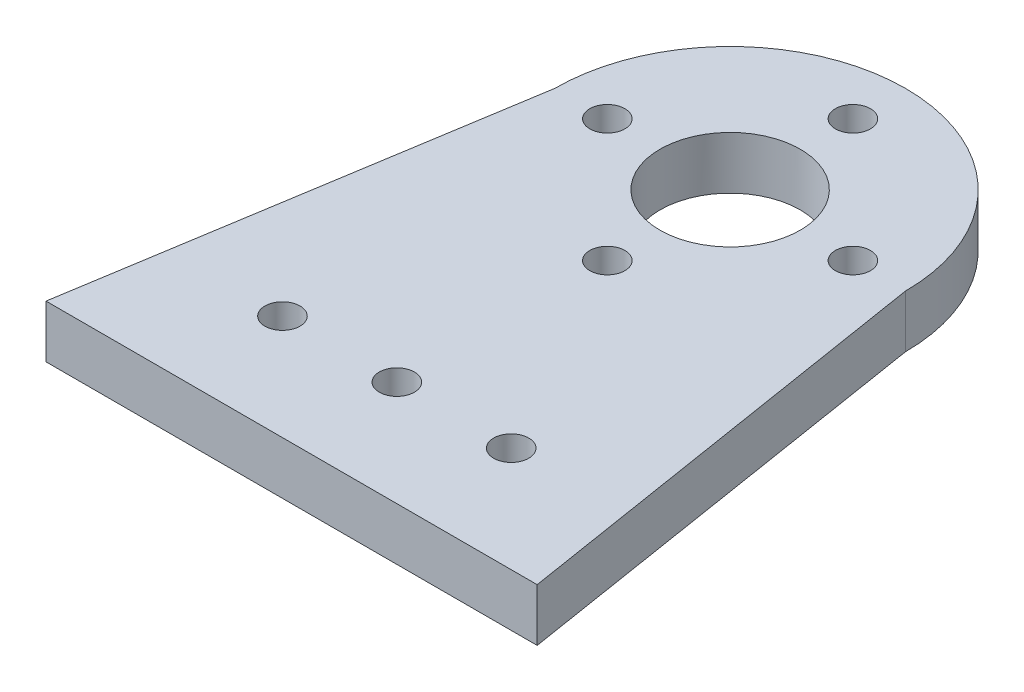
ISO-10303-21;
HEADER;
FILE_DESCRIPTION(('STEP AP214'),'2;1');
FILE_NAME('part.step','',(''),(''),'','','');
FILE_SCHEMA(('AUTOMOTIVE_DESIGN { 1 0 10303 214 1 1 1 1 }'));
ENDSEC;
DATA;
#1=APPLICATION_CONTEXT('core data for automotive mechanical design processes');
#2=APPLICATION_PROTOCOL_DEFINITION('international standard','automotive_design',2000,#1);
#3=PRODUCT_CONTEXT('',#1,'mechanical');
#4=PRODUCT('Part','Part','',(#3));
#5=PRODUCT_RELATED_PRODUCT_CATEGORY('part','',(#4));
#6=PRODUCT_DEFINITION_FORMATION('','',#4);
#7=PRODUCT_DEFINITION_CONTEXT('part definition',#1,'design');
#8=PRODUCT_DEFINITION('design','',#6,#7);
#9=PRODUCT_DEFINITION_SHAPE('','',#8);
#10=(LENGTH_UNIT() NAMED_UNIT(*) SI_UNIT(.MILLI.,.METRE.));
#11=(NAMED_UNIT(*) PLANE_ANGLE_UNIT() SI_UNIT($,.RADIAN.));
#12=(NAMED_UNIT(*) SI_UNIT($,.STERADIAN.) SOLID_ANGLE_UNIT());
#13=UNCERTAINTY_MEASURE_WITH_UNIT(LENGTH_MEASURE(1.E-05),#10,'distance_accuracy_value','');
#14=(GEOMETRIC_REPRESENTATION_CONTEXT(3) GLOBAL_UNCERTAINTY_ASSIGNED_CONTEXT((#13)) GLOBAL_UNIT_ASSIGNED_CONTEXT((#10,
#11,#12)) REPRESENTATION_CONTEXT('',''));
#15=CARTESIAN_POINT('',(0.,0.,0.));
#16=DIRECTION('',(0.,0.,1.));
#17=DIRECTION('',(1.,0.,0.));
#18=AXIS2_PLACEMENT_3D('',#15,#16,#17);
#19=CARTESIAN_POINT('',(0.,3.,0.));
#20=DIRECTION('',(0.,-1.,0.));
#21=DIRECTION('',(0.,0.,-1.));
#22=AXIS2_PLACEMENT_3D('',#19,#20,#21);
#23=CYLINDRICAL_SURFACE('',#22,10.);
#24=CARTESIAN_POINT('',(0.,0.,0.));
#25=DIRECTION('',(0.,1.,0.));
#26=DIRECTION('',(0.,0.,-1.));
#27=AXIS2_PLACEMENT_3D('',#24,#25,#26);
#28=CIRCLE('',#27,10.);
#29=CARTESIAN_POINT('',(10.,0.,0.));
#30=VERTEX_POINT('',#29);
#31=CARTESIAN_POINT('',(-10.,0.,0.));
#32=VERTEX_POINT('',#31);
#33=EDGE_CURVE('E99',#30,#32,#28,.T.);
#34=ORIENTED_EDGE('',*,*,#33,.T.);
#35=DIRECTION('',(0.,-1.,0.));
#36=VECTOR('',#35,1.);
#37=CARTESIAN_POINT('',(-10.,3.,0.));
#38=LINE('',#37,#36);
#39=CARTESIAN_POINT('',(-10.,3.,0.));
#40=VERTEX_POINT('',#39);
#41=EDGE_CURVE('E11',#40,#32,#38,.T.);
#42=ORIENTED_EDGE('',*,*,#41,.F.);
#43=CARTESIAN_POINT('',(0.,3.,0.));
#44=DIRECTION('',(0.,1.,0.));
#45=DIRECTION('',(0.,0.,-1.));
#46=AXIS2_PLACEMENT_3D('',#43,#44,#45);
#47=CIRCLE('',#46,10.);
#48=CARTESIAN_POINT('',(10.,3.,0.));
#49=VERTEX_POINT('',#48);
#50=EDGE_CURVE('E86',#49,#40,#47,.T.);
#51=ORIENTED_EDGE('',*,*,#50,.F.);
#52=DIRECTION('',(0.,-1.,0.));
#53=VECTOR('',#52,1.);
#54=CARTESIAN_POINT('',(10.,3.,0.));
#55=LINE('',#54,#53);
#56=EDGE_CURVE('E95',#49,#30,#55,.T.);
#57=ORIENTED_EDGE('',*,*,#56,.T.);
#58=EDGE_LOOP('',(#34,#42,#51,#57));
#59=FACE_BOUND('',#58,.T.);
#60=ADVANCED_FACE('F33',(#59),#23,.T.);
#61=CARTESIAN_POINT('',(-10.,3.,0.));
#62=DIRECTION('',(0.987440631916705,0.,0.157990501106673));
#63=DIRECTION('',(0.157990501106673,0.,-0.987440631916705));
#64=AXIS2_PLACEMENT_3D('',#61,#62,#63);
#65=PLANE('',#64);
#66=DIRECTION('',(-0.157990501106673,0.,0.987440631916705));
#67=VECTOR('',#66,1.);
#68=CARTESIAN_POINT('',(-10.,0.,0.));
#69=LINE('',#68,#67);
#70=CARTESIAN_POINT('',(-14.,0.,25.));
#71=VERTEX_POINT('',#70);
#72=EDGE_CURVE('E90',#32,#71,#69,.T.);
#73=ORIENTED_EDGE('',*,*,#72,.T.);
#74=DIRECTION('',(0.,-1.,0.));
#75=VECTOR('',#74,1.);
#76=CARTESIAN_POINT('',(-14.,3.,25.));
#77=LINE('',#76,#75);
#78=CARTESIAN_POINT('',(-14.,3.,25.));
#79=VERTEX_POINT('',#78);
#80=EDGE_CURVE('E42',#79,#71,#77,.T.);
#81=ORIENTED_EDGE('',*,*,#80,.F.);
#82=DIRECTION('',(-0.157990501106673,0.,0.987440631916705));
#83=VECTOR('',#82,1.);
#84=CARTESIAN_POINT('',(-10.,3.,0.));
#85=LINE('',#84,#83);
#86=EDGE_CURVE('E81',#40,#79,#85,.T.);
#87=ORIENTED_EDGE('',*,*,#86,.F.);
#88=ORIENTED_EDGE('',*,*,#41,.T.);
#89=EDGE_LOOP('',(#73,#81,#87,#88));
#90=FACE_BOUND('',#89,.T.);
#91=ADVANCED_FACE('F89',(#90),#65,.F.);
#92=CARTESIAN_POINT('',(-14.,3.,25.));
#93=DIRECTION('',(0.,0.,-1.));
#94=DIRECTION('',(-1.,0.,0.));
#95=AXIS2_PLACEMENT_3D('',#92,#93,#94);
#96=PLANE('',#95);
#97=DIRECTION('',(1.,0.,0.));
#98=VECTOR('',#97,1.);
#99=CARTESIAN_POINT('',(-14.,0.,25.));
#100=LINE('',#99,#98);
#101=CARTESIAN_POINT('',(14.,0.,25.));
#102=VERTEX_POINT('',#101);
#103=EDGE_CURVE('E68',#71,#102,#100,.T.);
#104=ORIENTED_EDGE('',*,*,#103,.T.);
#105=DIRECTION('',(0.,-1.,0.));
#106=VECTOR('',#105,1.);
#107=CARTESIAN_POINT('',(14.,3.,25.));
#108=LINE('',#107,#106);
#109=CARTESIAN_POINT('',(14.,3.,25.));
#110=VERTEX_POINT('',#109);
#111=EDGE_CURVE('E91',#110,#102,#108,.T.);
#112=ORIENTED_EDGE('',*,*,#111,.F.);
#113=DIRECTION('',(1.,0.,0.));
#114=VECTOR('',#113,1.);
#115=CARTESIAN_POINT('',(-14.,3.,25.));
#116=LINE('',#115,#114);
#117=EDGE_CURVE('E84',#79,#110,#116,.T.);
#118=ORIENTED_EDGE('',*,*,#117,.F.);
#119=ORIENTED_EDGE('',*,*,#80,.T.);
#120=EDGE_LOOP('',(#104,#112,#118,#119));
#121=FACE_BOUND('',#120,.T.);
#122=ADVANCED_FACE('F93',(#121),#96,.F.);
#123=CARTESIAN_POINT('',(10.,3.,0.));
#124=DIRECTION('',(-0.987440631916705,0.,0.157990501106673));
#125=DIRECTION('',(0.157990501106673,0.,0.987440631916705));
#126=AXIS2_PLACEMENT_3D('',#123,#124,#125);
#127=PLANE('',#126);
#128=DIRECTION('',(-0.157990501106673,0.,-0.987440631916705));
#129=VECTOR('',#128,1.);
#130=CARTESIAN_POINT('',(10.,0.,0.));
#131=LINE('',#130,#129);
#132=EDGE_CURVE('E74',#102,#30,#131,.T.);
#133=ORIENTED_EDGE('',*,*,#132,.T.);
#134=ORIENTED_EDGE('',*,*,#56,.F.);
#135=DIRECTION('',(-0.157990501106673,0.,-0.987440631916705));
#136=VECTOR('',#135,1.);
#137=CARTESIAN_POINT('',(10.,3.,0.));
#138=LINE('',#137,#136);
#139=EDGE_CURVE('E51',#110,#49,#138,.T.);
#140=ORIENTED_EDGE('',*,*,#139,.F.);
#141=ORIENTED_EDGE('',*,*,#111,.T.);
#142=EDGE_LOOP('',(#133,#134,#140,#141));
#143=FACE_BOUND('',#142,.T.);
#144=ADVANCED_FACE('F137',(#143),#127,.F.);
#145=CARTESIAN_POINT('',(0.,3.,0.));
#146=DIRECTION('',(0.,-1.,0.));
#147=DIRECTION('',(0.,0.,-1.));
#148=AXIS2_PLACEMENT_3D('',#145,#146,#147);
#149=PLANE('',#148);
#150=CARTESIAN_POINT('',(7.,3.,0.));
#151=DIRECTION('',(0.,1.,0.));
#152=DIRECTION('',(0.,0.,1.));
#153=AXIS2_PLACEMENT_3D('',#150,#151,#152);
#154=CIRCLE('',#153,1.);
#155=CARTESIAN_POINT('',(7.,3.,1.00000000000007));
#156=VERTEX_POINT('',#155);
#157=EDGE_CURVE('E263',#156,#156,#154,.T.);
#158=ORIENTED_EDGE('',*,*,#157,.F.);
#159=EDGE_LOOP('',(#158));
#160=FACE_BOUND('',#159,.T.);
#161=CARTESIAN_POINT('',(0.,3.,-7.));
#162=DIRECTION('',(0.,1.,0.));
#163=DIRECTION('',(0.,0.,1.));
#164=AXIS2_PLACEMENT_3D('',#161,#162,#163);
#165=CIRCLE('',#164,1.);
#166=CARTESIAN_POINT('',(0.,3.,-6.));
#167=VERTEX_POINT('',#166);
#168=EDGE_CURVE('E265',#167,#167,#165,.T.);
#169=ORIENTED_EDGE('',*,*,#168,.F.);
#170=EDGE_LOOP('',(#169));
#171=FACE_BOUND('',#170,.T.);
#172=CARTESIAN_POINT('',(-7.,3.,0.));
#173=DIRECTION('',(0.,1.,0.));
#174=DIRECTION('',(0.,0.,1.));
#175=AXIS2_PLACEMENT_3D('',#172,#173,#174);
#176=CIRCLE('',#175,1.);
#177=CARTESIAN_POINT('',(-7.,3.,0.999999999999975));
#178=VERTEX_POINT('',#177);
#179=EDGE_CURVE('E271',#178,#178,#176,.T.);
#180=ORIENTED_EDGE('',*,*,#179,.F.);
#181=EDGE_LOOP('',(#180));
#182=FACE_BOUND('',#181,.T.);
#183=CARTESIAN_POINT('',(0.,3.,7.));
#184=DIRECTION('',(0.,1.,0.));
#185=DIRECTION('',(0.,0.,1.));
#186=AXIS2_PLACEMENT_3D('',#183,#184,#185);
#187=CIRCLE('',#186,1.);
#188=CARTESIAN_POINT('',(0.,3.,8.));
#189=VERTEX_POINT('',#188);
#190=EDGE_CURVE('E277',#189,#189,#187,.T.);
#191=ORIENTED_EDGE('',*,*,#190,.F.);
#192=EDGE_LOOP('',(#191));
#193=FACE_BOUND('',#192,.T.);
#194=CARTESIAN_POINT('',(0.,3.,19.));
#195=DIRECTION('',(0.,1.,0.));
#196=DIRECTION('',(0.,0.,1.));
#197=AXIS2_PLACEMENT_3D('',#194,#195,#196);
#198=CIRCLE('',#197,1.);
#199=CARTESIAN_POINT('',(0.,3.,20.));
#200=VERTEX_POINT('',#199);
#201=EDGE_CURVE('E126',#200,#200,#198,.T.);
#202=ORIENTED_EDGE('',*,*,#201,.F.);
#203=EDGE_LOOP('',(#202));
#204=FACE_BOUND('',#203,.T.);
#205=CARTESIAN_POINT('',(6.52,3.,19.));
#206=DIRECTION('',(0.,1.,0.));
#207=DIRECTION('',(0.,0.,-1.));
#208=AXIS2_PLACEMENT_3D('',#205,#206,#207);
#209=CIRCLE('',#208,1.);
#210=CARTESIAN_POINT('',(6.52,3.,18.));
#211=VERTEX_POINT('',#210);
#212=EDGE_CURVE('E116',#211,#211,#209,.T.);
#213=ORIENTED_EDGE('',*,*,#212,.F.);
#214=EDGE_LOOP('',(#213));
#215=FACE_BOUND('',#214,.T.);
#216=CARTESIAN_POINT('',(-6.52,3.,19.));
#217=DIRECTION('',(0.,1.,0.));
#218=DIRECTION('',(0.,0.,1.));
#219=AXIS2_PLACEMENT_3D('',#216,#217,#218);
#220=CIRCLE('',#219,1.);
#221=CARTESIAN_POINT('',(-6.52,3.,20.));
#222=VERTEX_POINT('',#221);
#223=EDGE_CURVE('E113',#222,#222,#220,.T.);
#224=ORIENTED_EDGE('',*,*,#223,.F.);
#225=EDGE_LOOP('',(#224));
#226=FACE_BOUND('',#225,.T.);
#227=CARTESIAN_POINT('',(0.,3.,0.));
#228=DIRECTION('',(0.,1.,0.));
#229=DIRECTION('',(0.,0.,1.));
#230=AXIS2_PLACEMENT_3D('',#227,#228,#229);
#231=CIRCLE('',#230,4.);
#232=CARTESIAN_POINT('',(0.,3.,4.));
#233=VERTEX_POINT('',#232);
#234=EDGE_CURVE('E110',#233,#233,#231,.T.);
#235=ORIENTED_EDGE('',*,*,#234,.F.);
#236=EDGE_LOOP('',(#235));
#237=FACE_BOUND('',#236,.T.);
#238=ORIENTED_EDGE('',*,*,#50,.T.);
#239=ORIENTED_EDGE('',*,*,#86,.T.);
#240=ORIENTED_EDGE('',*,*,#117,.T.);
#241=ORIENTED_EDGE('',*,*,#139,.T.);
#242=EDGE_LOOP('',(#238,#239,#240,#241));
#243=FACE_BOUND('',#242,.T.);
#244=ADVANCED_FACE('F82',(#160,#171,#182,#193,#204,#215,#226,#237,#243),#149,.F.);
#245=CARTESIAN_POINT('',(0.,0.,0.));
#246=DIRECTION('',(0.,-1.,0.));
#247=DIRECTION('',(0.,0.,-1.));
#248=AXIS2_PLACEMENT_3D('',#245,#246,#247);
#249=PLANE('',#248);
#250=CARTESIAN_POINT('',(7.,0.,0.));
#251=DIRECTION('',(0.,1.,0.));
#252=DIRECTION('',(0.,0.,1.));
#253=AXIS2_PLACEMENT_3D('',#250,#251,#252);
#254=CIRCLE('',#253,1.);
#255=CARTESIAN_POINT('',(7.,0.,1.00000000000007));
#256=VERTEX_POINT('',#255);
#257=EDGE_CURVE('E261',#256,#256,#254,.T.);
#258=ORIENTED_EDGE('',*,*,#257,.T.);
#259=EDGE_LOOP('',(#258));
#260=FACE_BOUND('',#259,.T.);
#261=CARTESIAN_POINT('',(0.,0.,-7.));
#262=DIRECTION('',(0.,1.,0.));
#263=DIRECTION('',(0.,0.,1.));
#264=AXIS2_PLACEMENT_3D('',#261,#262,#263);
#265=CIRCLE('',#264,1.);
#266=CARTESIAN_POINT('',(0.,0.,-6.));
#267=VERTEX_POINT('',#266);
#268=EDGE_CURVE('E268',#267,#267,#265,.T.);
#269=ORIENTED_EDGE('',*,*,#268,.T.);
#270=EDGE_LOOP('',(#269));
#271=FACE_BOUND('',#270,.T.);
#272=CARTESIAN_POINT('',(-7.,0.,0.));
#273=DIRECTION('',(0.,1.,0.));
#274=DIRECTION('',(0.,0.,1.));
#275=AXIS2_PLACEMENT_3D('',#272,#273,#274);
#276=CIRCLE('',#275,1.);
#277=CARTESIAN_POINT('',(-7.,0.,0.999999999999975));
#278=VERTEX_POINT('',#277);
#279=EDGE_CURVE('E274',#278,#278,#276,.T.);
#280=ORIENTED_EDGE('',*,*,#279,.T.);
#281=EDGE_LOOP('',(#280));
#282=FACE_BOUND('',#281,.T.);
#283=CARTESIAN_POINT('',(0.,0.,7.));
#284=DIRECTION('',(0.,1.,0.));
#285=DIRECTION('',(0.,0.,1.));
#286=AXIS2_PLACEMENT_3D('',#283,#284,#285);
#287=CIRCLE('',#286,1.);
#288=CARTESIAN_POINT('',(0.,0.,8.));
#289=VERTEX_POINT('',#288);
#290=EDGE_CURVE('E280',#289,#289,#287,.T.);
#291=ORIENTED_EDGE('',*,*,#290,.T.);
#292=EDGE_LOOP('',(#291));
#293=FACE_BOUND('',#292,.T.);
#294=CARTESIAN_POINT('',(0.,0.,19.));
#295=DIRECTION('',(0.,-1.,0.));
#296=DIRECTION('',(0.,0.,-1.));
#297=AXIS2_PLACEMENT_3D('',#294,#295,#296);
#298=CIRCLE('',#297,1.);
#299=CARTESIAN_POINT('',(0.,0.,18.));
#300=VERTEX_POINT('',#299);
#301=EDGE_CURVE('E36',#300,#300,#298,.T.);
#302=ORIENTED_EDGE('',*,*,#301,.F.);
#303=EDGE_LOOP('',(#302));
#304=FACE_BOUND('',#303,.T.);
#305=CARTESIAN_POINT('',(6.52,0.,19.));
#306=DIRECTION('',(0.,-1.,0.));
#307=DIRECTION('',(0.,0.,-1.));
#308=AXIS2_PLACEMENT_3D('',#305,#306,#307);
#309=CIRCLE('',#308,1.);
#310=CARTESIAN_POINT('',(6.52,0.,18.));
#311=VERTEX_POINT('',#310);
#312=EDGE_CURVE('E114',#311,#311,#309,.T.);
#313=ORIENTED_EDGE('',*,*,#312,.F.);
#314=EDGE_LOOP('',(#313));
#315=FACE_BOUND('',#314,.T.);
#316=CARTESIAN_POINT('',(-6.52,0.,19.));
#317=DIRECTION('',(0.,-1.,0.));
#318=DIRECTION('',(0.,0.,-1.));
#319=AXIS2_PLACEMENT_3D('',#316,#317,#318);
#320=CIRCLE('',#319,1.);
#321=CARTESIAN_POINT('',(-6.52,0.,18.));
#322=VERTEX_POINT('',#321);
#323=EDGE_CURVE('E111',#322,#322,#320,.T.);
#324=ORIENTED_EDGE('',*,*,#323,.F.);
#325=EDGE_LOOP('',(#324));
#326=FACE_BOUND('',#325,.T.);
#327=CARTESIAN_POINT('',(0.,0.,0.));
#328=DIRECTION('',(0.,-1.,0.));
#329=DIRECTION('',(0.,0.,-1.));
#330=AXIS2_PLACEMENT_3D('',#327,#328,#329);
#331=CIRCLE('',#330,4.);
#332=CARTESIAN_POINT('',(0.,0.,-4.));
#333=VERTEX_POINT('',#332);
#334=EDGE_CURVE('E102',#333,#333,#331,.T.);
#335=ORIENTED_EDGE('',*,*,#334,.F.);
#336=EDGE_LOOP('',(#335));
#337=FACE_BOUND('',#336,.T.);
#338=ORIENTED_EDGE('',*,*,#33,.F.);
#339=ORIENTED_EDGE('',*,*,#132,.F.);
#340=ORIENTED_EDGE('',*,*,#103,.F.);
#341=ORIENTED_EDGE('',*,*,#72,.F.);
#342=EDGE_LOOP('',(#338,#339,#340,#341));
#343=FACE_BOUND('',#342,.T.);
#344=ADVANCED_FACE('F136',(#260,#271,#282,#293,#304,#315,#326,#337,#343),#249,.T.);
#345=CARTESIAN_POINT('',(0.,-10.,0.));
#346=DIRECTION('',(0.,1.,0.));
#347=DIRECTION('',(0.,0.,1.));
#348=AXIS2_PLACEMENT_3D('',#345,#346,#347);
#349=CYLINDRICAL_SURFACE('',#348,4.);
#350=ORIENTED_EDGE('',*,*,#334,.T.);
#351=EDGE_LOOP('',(#350));
#352=FACE_BOUND('',#351,.T.);
#353=ORIENTED_EDGE('',*,*,#234,.T.);
#354=EDGE_LOOP('',(#353));
#355=FACE_BOUND('',#354,.T.);
#356=ADVANCED_FACE('F133',(#352,#355),#349,.F.);
#357=CARTESIAN_POINT('',(-6.52,-10.,19.));
#358=DIRECTION('',(0.,1.,0.));
#359=DIRECTION('',(0.,0.,1.));
#360=AXIS2_PLACEMENT_3D('',#357,#358,#359);
#361=CYLINDRICAL_SURFACE('',#360,1.);
#362=ORIENTED_EDGE('',*,*,#323,.T.);
#363=EDGE_LOOP('',(#362));
#364=FACE_BOUND('',#363,.T.);
#365=ORIENTED_EDGE('',*,*,#223,.T.);
#366=EDGE_LOOP('',(#365));
#367=FACE_BOUND('',#366,.T.);
#368=ADVANCED_FACE('F177',(#364,#367),#361,.F.);
#369=CARTESIAN_POINT('',(6.52,-10.,19.));
#370=DIRECTION('',(0.,1.,0.));
#371=DIRECTION('',(0.,0.,1.));
#372=AXIS2_PLACEMENT_3D('',#369,#370,#371);
#373=CYLINDRICAL_SURFACE('',#372,1.);
#374=ORIENTED_EDGE('',*,*,#312,.T.);
#375=EDGE_LOOP('',(#374));
#376=FACE_BOUND('',#375,.T.);
#377=ORIENTED_EDGE('',*,*,#212,.T.);
#378=EDGE_LOOP('',(#377));
#379=FACE_BOUND('',#378,.T.);
#380=ADVANCED_FACE('F187',(#376,#379),#373,.F.);
#381=CARTESIAN_POINT('',(0.,-10.,19.));
#382=DIRECTION('',(0.,1.,0.));
#383=DIRECTION('',(0.,0.,1.));
#384=AXIS2_PLACEMENT_3D('',#381,#382,#383);
#385=CYLINDRICAL_SURFACE('',#384,1.);
#386=ORIENTED_EDGE('',*,*,#301,.T.);
#387=EDGE_LOOP('',(#386));
#388=FACE_BOUND('',#387,.T.);
#389=ORIENTED_EDGE('',*,*,#201,.T.);
#390=EDGE_LOOP('',(#389));
#391=FACE_BOUND('',#390,.T.);
#392=ADVANCED_FACE('F197',(#388,#391),#385,.F.);
#393=CARTESIAN_POINT('',(0.,0.,7.));
#394=DIRECTION('',(0.,1.,0.));
#395=DIRECTION('',(0.,0.,1.));
#396=AXIS2_PLACEMENT_3D('',#393,#394,#395);
#397=CYLINDRICAL_SURFACE('',#396,1.);
#398=ORIENTED_EDGE('',*,*,#290,.F.);
#399=EDGE_LOOP('',(#398));
#400=FACE_BOUND('',#399,.T.);
#401=ORIENTED_EDGE('',*,*,#190,.T.);
#402=EDGE_LOOP('',(#401));
#403=FACE_BOUND('',#402,.T.);
#404=ADVANCED_FACE('F205',(#400,#403),#397,.F.);
#405=CARTESIAN_POINT('',(-7.,0.,0.));
#406=DIRECTION('',(0.,1.,0.));
#407=DIRECTION('',(0.,0.,1.));
#408=AXIS2_PLACEMENT_3D('',#405,#406,#407);
#409=CYLINDRICAL_SURFACE('',#408,1.);
#410=ORIENTED_EDGE('',*,*,#279,.F.);
#411=EDGE_LOOP('',(#410));
#412=FACE_BOUND('',#411,.T.);
#413=ORIENTED_EDGE('',*,*,#179,.T.);
#414=EDGE_LOOP('',(#413));
#415=FACE_BOUND('',#414,.T.);
#416=ADVANCED_FACE('F224',(#412,#415),#409,.F.);
#417=CARTESIAN_POINT('',(0.,0.,-7.));
#418=DIRECTION('',(0.,1.,0.));
#419=DIRECTION('',(0.,0.,1.));
#420=AXIS2_PLACEMENT_3D('',#417,#418,#419);
#421=CYLINDRICAL_SURFACE('',#420,1.);
#422=ORIENTED_EDGE('',*,*,#268,.F.);
#423=EDGE_LOOP('',(#422));
#424=FACE_BOUND('',#423,.T.);
#425=ORIENTED_EDGE('',*,*,#168,.T.);
#426=EDGE_LOOP('',(#425));
#427=FACE_BOUND('',#426,.T.);
#428=ADVANCED_FACE('F234',(#424,#427),#421,.F.);
#429=CARTESIAN_POINT('',(7.,0.,0.));
#430=DIRECTION('',(0.,1.,0.));
#431=DIRECTION('',(0.,0.,1.));
#432=AXIS2_PLACEMENT_3D('',#429,#430,#431);
#433=CYLINDRICAL_SURFACE('',#432,1.);
#434=ORIENTED_EDGE('',*,*,#257,.F.);
#435=EDGE_LOOP('',(#434));
#436=FACE_BOUND('',#435,.T.);
#437=ORIENTED_EDGE('',*,*,#157,.T.);
#438=EDGE_LOOP('',(#437));
#439=FACE_BOUND('',#438,.T.);
#440=ADVANCED_FACE('F244',(#436,#439),#433,.F.);
#441=CLOSED_SHELL('',(#60,#91,#122,#144,#244,#344,#356,#368,#380,#392,#404,#416,#428,#440));
#442=MANIFOLD_SOLID_BREP('B2',#441);
#443=ADVANCED_BREP_SHAPE_REPRESENTATION('',(#18,#442),#14);
#444=SHAPE_DEFINITION_REPRESENTATION(#9,#443);
ENDSEC;
END-ISO-10303-21;
